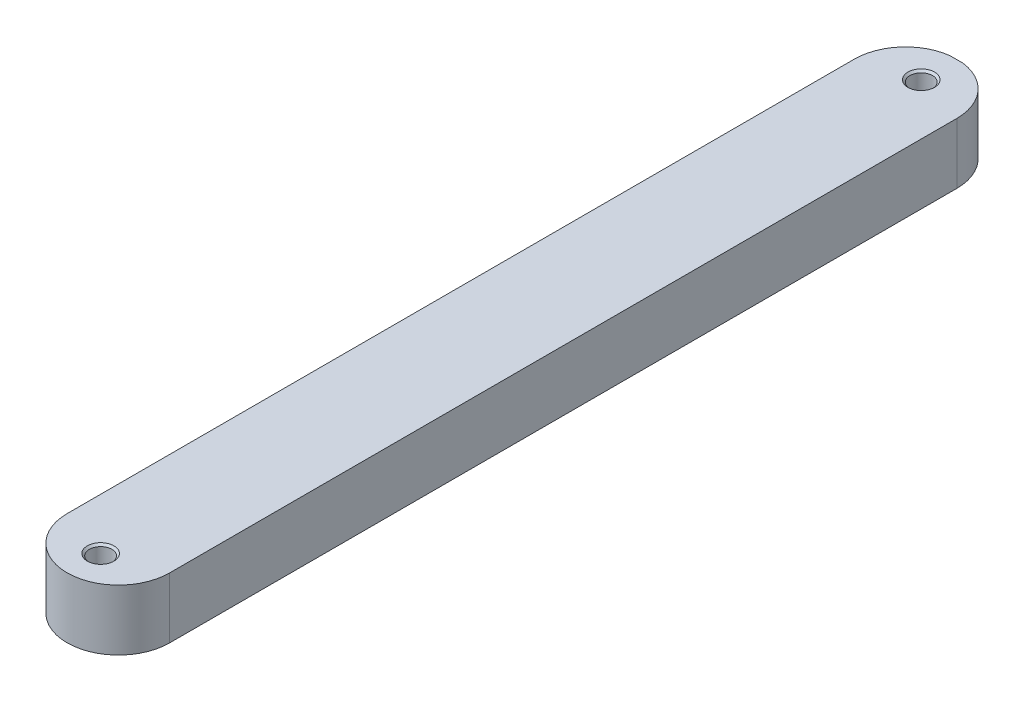
ISO-10303-21;
HEADER;
FILE_DESCRIPTION(('STEP AP214'),'2;1');
FILE_NAME('part.step','',(''),(''),'','','');
FILE_SCHEMA(('AUTOMOTIVE_DESIGN { 1 0 10303 214 1 1 1 1 }'));
ENDSEC;
DATA;
#1=APPLICATION_CONTEXT('core data for automotive mechanical design processes');
#2=APPLICATION_PROTOCOL_DEFINITION('international standard','automotive_design',2000,#1);
#3=PRODUCT_CONTEXT('',#1,'mechanical');
#4=PRODUCT('Part','Part','',(#3));
#5=PRODUCT_RELATED_PRODUCT_CATEGORY('part','',(#4));
#6=PRODUCT_DEFINITION_FORMATION('','',#4);
#7=PRODUCT_DEFINITION_CONTEXT('part definition',#1,'design');
#8=PRODUCT_DEFINITION('design','',#6,#7);
#9=PRODUCT_DEFINITION_SHAPE('','',#8);
#10=(LENGTH_UNIT() NAMED_UNIT(*) SI_UNIT(.MILLI.,.METRE.));
#11=(NAMED_UNIT(*) PLANE_ANGLE_UNIT() SI_UNIT($,.RADIAN.));
#12=(NAMED_UNIT(*) SI_UNIT($,.STERADIAN.) SOLID_ANGLE_UNIT());
#13=UNCERTAINTY_MEASURE_WITH_UNIT(LENGTH_MEASURE(1.E-05),#10,'distance_accuracy_value','');
#14=(GEOMETRIC_REPRESENTATION_CONTEXT(3) GLOBAL_UNCERTAINTY_ASSIGNED_CONTEXT((#13)) GLOBAL_UNIT_ASSIGNED_CONTEXT((#10,
#11,#12)) REPRESENTATION_CONTEXT('',''));
#15=CARTESIAN_POINT('',(0.,0.,0.));
#16=DIRECTION('',(0.,0.,1.));
#17=DIRECTION('',(1.,0.,0.));
#18=AXIS2_PLACEMENT_3D('',#15,#16,#17);
#19=CARTESIAN_POINT('',(30.,0.,0.));
#20=DIRECTION('',(1.,0.,0.));
#21=DIRECTION('',(0.,0.,-1.));
#22=AXIS2_PLACEMENT_3D('',#19,#20,#21);
#23=PLANE('',#22);
#24=DIRECTION('',(0.,1.,0.));
#25=VECTOR('',#24,1.);
#26=CARTESIAN_POINT('',(30.,-31.081342300485,-215.122561861937));
#27=LINE('',#26,#25);
#28=CARTESIAN_POINT('',(30.,-18.8062966576299,-215.122561861937));
#29=VERTEX_POINT('',#28);
#30=CARTESIAN_POINT('',(30.,-1.081342300485,-215.122561861937));
#31=VERTEX_POINT('',#30);
#32=EDGE_CURVE('E136',#29,#31,#27,.T.);
#33=ORIENTED_EDGE('',*,*,#32,.T.);
#34=DIRECTION('',(0.,0.,-1.));
#35=VECTOR('',#34,1.);
#36=CARTESIAN_POINT('',(30.,-1.081342300485,30.));
#37=LINE('',#36,#35);
#38=CARTESIAN_POINT('',(30.,-1.081342300485,15.));
#39=VERTEX_POINT('',#38);
#40=EDGE_CURVE('E120',#39,#31,#37,.T.);
#41=ORIENTED_EDGE('',*,*,#40,.F.);
#42=DIRECTION('',(0.,1.,0.));
#43=VECTOR('',#42,1.);
#44=CARTESIAN_POINT('',(30.,-19.081342300485,15.));
#45=LINE('',#44,#43);
#46=CARTESIAN_POINT('',(30.,-18.8062966576299,15.));
#47=VERTEX_POINT('',#46);
#48=EDGE_CURVE('E170',#47,#39,#45,.T.);
#49=ORIENTED_EDGE('',*,*,#48,.F.);
#50=DIRECTION('',(0.,0.,-1.));
#51=VECTOR('',#50,1.);
#52=CARTESIAN_POINT('',(30.,-18.8062966576299,30.));
#53=LINE('',#52,#51);
#54=EDGE_CURVE('E183',#47,#29,#53,.T.);
#55=ORIENTED_EDGE('',*,*,#54,.T.);
#56=EDGE_LOOP('',(#33,#41,#49,#55));
#57=FACE_BOUND('',#56,.T.);
#58=ADVANCED_FACE('F58',(#57),#23,.T.);
#59=CARTESIAN_POINT('',(0.,0.,0.));
#60=DIRECTION('',(1.,0.,0.));
#61=DIRECTION('',(0.,0.,-1.));
#62=AXIS2_PLACEMENT_3D('',#59,#60,#61);
#63=PLANE('',#62);
#64=DIRECTION('',(0.,0.,-1.));
#65=VECTOR('',#64,1.);
#66=CARTESIAN_POINT('',(0.,-1.081342300485,30.));
#67=LINE('',#66,#65);
#68=CARTESIAN_POINT('',(0.,-1.081342300485,15.));
#69=VERTEX_POINT('',#68);
#70=CARTESIAN_POINT('',(0.,-1.081342300485,-215.122561861937));
#71=VERTEX_POINT('',#70);
#72=EDGE_CURVE('E114',#69,#71,#67,.T.);
#73=ORIENTED_EDGE('',*,*,#72,.T.);
#74=DIRECTION('',(0.,1.,0.));
#75=VECTOR('',#74,1.);
#76=CARTESIAN_POINT('',(0.,-31.081342300485,-215.122561861937));
#77=LINE('',#76,#75);
#78=CARTESIAN_POINT('',(0.,-18.8062966576299,-215.122561861937));
#79=VERTEX_POINT('',#78);
#80=EDGE_CURVE('E116',#79,#71,#77,.T.);
#81=ORIENTED_EDGE('',*,*,#80,.F.);
#82=DIRECTION('',(0.,0.,-1.));
#83=VECTOR('',#82,1.);
#84=CARTESIAN_POINT('',(0.,-18.8062966576299,30.));
#85=LINE('',#84,#83);
#86=CARTESIAN_POINT('',(0.,-18.8062966576299,15.));
#87=VERTEX_POINT('',#86);
#88=EDGE_CURVE('E186',#87,#79,#85,.T.);
#89=ORIENTED_EDGE('',*,*,#88,.F.);
#90=DIRECTION('',(0.,1.,0.));
#91=VECTOR('',#90,1.);
#92=CARTESIAN_POINT('',(0.,-19.081342300485,15.));
#93=LINE('',#92,#91);
#94=EDGE_CURVE('E117',#87,#69,#93,.T.);
#95=ORIENTED_EDGE('',*,*,#94,.T.);
#96=EDGE_LOOP('',(#73,#81,#89,#95));
#97=FACE_BOUND('',#96,.T.);
#98=ADVANCED_FACE('F60',(#97),#63,.F.);
#99=CARTESIAN_POINT('',(0.,0.,-230.));
#100=DIRECTION('',(0.,0.,-1.));
#101=DIRECTION('',(-1.,0.,0.));
#102=AXIS2_PLACEMENT_3D('',#99,#100,#101);
#103=PLANE('',#102);
#104=DIRECTION('',(-1.,0.,0.));
#105=VECTOR('',#104,1.);
#106=CARTESIAN_POINT('',(30.,-18.8062966576299,-230.));
#107=LINE('',#106,#105);
#108=CARTESIAN_POINT('',(16.9135920276072,-18.8062966576299,-230.));
#109=VERTEX_POINT('',#108);
#110=CARTESIAN_POINT('',(13.0864079723928,-18.8062966576299,-230.));
#111=VERTEX_POINT('',#110);
#112=EDGE_CURVE('E152',#109,#111,#107,.T.);
#113=ORIENTED_EDGE('',*,*,#112,.T.);
#114=DIRECTION('',(0.,1.,0.));
#115=VECTOR('',#114,1.);
#116=CARTESIAN_POINT('',(13.0864079723928,-31.081342300485,-230.));
#117=LINE('',#116,#115);
#118=CARTESIAN_POINT('',(13.0864079723928,-1.081342300485,-230.));
#119=VERTEX_POINT('',#118);
#120=EDGE_CURVE('E12',#111,#119,#117,.T.);
#121=ORIENTED_EDGE('',*,*,#120,.T.);
#122=DIRECTION('',(1.,0.,0.));
#123=VECTOR('',#122,1.);
#124=CARTESIAN_POINT('',(30.,-1.081342300485,-230.));
#125=LINE('',#124,#123);
#126=CARTESIAN_POINT('',(16.9135920276072,-1.081342300485,-230.));
#127=VERTEX_POINT('',#126);
#128=EDGE_CURVE('E134',#119,#127,#125,.T.);
#129=ORIENTED_EDGE('',*,*,#128,.T.);
#130=DIRECTION('',(0.,1.,0.));
#131=VECTOR('',#130,1.);
#132=CARTESIAN_POINT('',(16.9135920276072,-31.081342300485,-230.));
#133=LINE('',#132,#131);
#134=EDGE_CURVE('E67',#127,#109,#133,.F.);
#135=ORIENTED_EDGE('',*,*,#134,.T.);
#136=EDGE_LOOP('',(#113,#121,#129,#135));
#137=FACE_BOUND('',#136,.T.);
#138=ADVANCED_FACE('F191',(#137),#103,.T.);
#139=CARTESIAN_POINT('',(0.,-1.081342300485,30.));
#140=DIRECTION('',(0.,-1.,0.));
#141=DIRECTION('',(0.,0.,-1.));
#142=AXIS2_PLACEMENT_3D('',#139,#140,#141);
#143=PLANE('',#142);
#144=CARTESIAN_POINT('',(15.,-1.081342300485,15.));
#145=DIRECTION('',(0.,1.,0.));
#146=DIRECTION('',(0.,0.,1.));
#147=AXIS2_PLACEMENT_3D('',#144,#145,#146);
#148=CIRCLE('',#147,15.);
#149=EDGE_CURVE('E174',#69,#39,#148,.T.);
#150=ORIENTED_EDGE('',*,*,#149,.T.);
#151=ORIENTED_EDGE('',*,*,#40,.T.);
#152=CARTESIAN_POINT('',(15.,-1.081342300485,-215.122561861937));
#153=DIRECTION('',(0.,1.,0.));
#154=DIRECTION('',(0.,0.,1.));
#155=AXIS2_PLACEMENT_3D('',#152,#153,#154);
#156=CIRCLE('',#155,15.);
#157=EDGE_CURVE('E140',#31,#127,#156,.T.);
#158=ORIENTED_EDGE('',*,*,#157,.T.);
#159=ORIENTED_EDGE('',*,*,#128,.F.);
#160=CARTESIAN_POINT('',(15.,-1.081342300485,-215.122561861937));
#161=DIRECTION('',(0.,1.,0.));
#162=DIRECTION('',(0.,0.,1.));
#163=AXIS2_PLACEMENT_3D('',#160,#161,#162);
#164=CIRCLE('',#163,15.);
#165=EDGE_CURVE('E74',#119,#71,#164,.T.);
#166=ORIENTED_EDGE('',*,*,#165,.T.);
#167=ORIENTED_EDGE('',*,*,#72,.F.);
#168=EDGE_LOOP('',(#150,#151,#158,#159,#166,#167));
#169=FACE_BOUND('',#168,.T.);
#170=CARTESIAN_POINT('',(15.,-1.081342300485,20.2038916555903));
#171=DIRECTION('',(0.,1.,0.));
#172=DIRECTION('',(0.,0.,1.));
#173=AXIS2_PLACEMENT_3D('',#170,#171,#172);
#174=CIRCLE('',#173,3.8865);
#175=CARTESIAN_POINT('',(15.,-1.081342300485,24.0903916555903));
#176=VERTEX_POINT('',#175);
#177=EDGE_CURVE('E158',#176,#176,#174,.T.);
#178=ORIENTED_EDGE('',*,*,#177,.F.);
#179=EDGE_LOOP('',(#178));
#180=FACE_BOUND('',#179,.T.);
#181=CARTESIAN_POINT('',(15.,-1.081342300485,-219.701584921538));
#182=DIRECTION('',(0.,1.,0.));
#183=DIRECTION('',(0.,0.,1.));
#184=AXIS2_PLACEMENT_3D('',#181,#182,#183);
#185=CIRCLE('',#184,3.8865);
#186=CARTESIAN_POINT('',(15.,-1.081342300485,-215.815084921538));
#187=VERTEX_POINT('',#186);
#188=EDGE_CURVE('E345',#187,#187,#185,.T.);
#189=ORIENTED_EDGE('',*,*,#188,.F.);
#190=EDGE_LOOP('',(#189));
#191=FACE_BOUND('',#190,.T.);
#192=ADVANCED_FACE('F130',(#169,#180,#191),#143,.F.);
#193=CARTESIAN_POINT('',(0.,-18.8062966576299,30.));
#194=DIRECTION('',(0.,1.,0.));
#195=DIRECTION('',(0.,0.,1.));
#196=AXIS2_PLACEMENT_3D('',#193,#194,#195);
#197=PLANE('',#196);
#198=CARTESIAN_POINT('',(15.,-18.8062966576299,20.2038916555903));
#199=DIRECTION('',(0.,1.,0.));
#200=DIRECTION('',(0.,0.,1.));
#201=AXIS2_PLACEMENT_3D('',#198,#199,#200);
#202=CIRCLE('',#201,3.3);
#203=CARTESIAN_POINT('',(15.,-18.8062966576299,23.5038916555903));
#204=VERTEX_POINT('',#203);
#205=EDGE_CURVE('E166',#204,#204,#202,.T.);
#206=ORIENTED_EDGE('',*,*,#205,.T.);
#207=EDGE_LOOP('',(#206));
#208=FACE_BOUND('',#207,.T.);
#209=ORIENTED_EDGE('',*,*,#54,.F.);
#210=CARTESIAN_POINT('',(15.,-18.8062966576299,15.));
#211=DIRECTION('',(0.,1.,0.));
#212=DIRECTION('',(0.,0.,1.));
#213=AXIS2_PLACEMENT_3D('',#210,#211,#212);
#214=CIRCLE('',#213,15.);
#215=EDGE_CURVE('E121',#87,#47,#214,.T.);
#216=ORIENTED_EDGE('',*,*,#215,.F.);
#217=ORIENTED_EDGE('',*,*,#88,.T.);
#218=CARTESIAN_POINT('',(15.,-18.8062966576299,-215.122561861937));
#219=DIRECTION('',(0.,1.,0.));
#220=DIRECTION('',(0.,0.,1.));
#221=AXIS2_PLACEMENT_3D('',#218,#219,#220);
#222=CIRCLE('',#221,15.);
#223=EDGE_CURVE('E126',#111,#79,#222,.T.);
#224=ORIENTED_EDGE('',*,*,#223,.F.);
#225=ORIENTED_EDGE('',*,*,#112,.F.);
#226=CARTESIAN_POINT('',(15.,-18.8062966576299,-215.122561861937));
#227=DIRECTION('',(0.,1.,0.));
#228=DIRECTION('',(0.,0.,1.));
#229=AXIS2_PLACEMENT_3D('',#226,#227,#228);
#230=CIRCLE('',#229,15.);
#231=EDGE_CURVE('E81',#29,#109,#230,.T.);
#232=ORIENTED_EDGE('',*,*,#231,.F.);
#233=EDGE_LOOP('',(#209,#216,#217,#224,#225,#232));
#234=FACE_BOUND('',#233,.T.);
#235=CARTESIAN_POINT('',(15.,-18.8062966576299,-219.701584921538));
#236=DIRECTION('',(0.,1.,0.));
#237=DIRECTION('',(0.,0.,1.));
#238=AXIS2_PLACEMENT_3D('',#235,#236,#237);
#239=CIRCLE('',#238,3.29999999999999);
#240=CARTESIAN_POINT('',(15.,-18.8062966576299,-216.401584921538));
#241=VERTEX_POINT('',#240);
#242=EDGE_CURVE('E143',#241,#241,#239,.T.);
#243=ORIENTED_EDGE('',*,*,#242,.T.);
#244=EDGE_LOOP('',(#243));
#245=FACE_BOUND('',#244,.T.);
#246=ADVANCED_FACE('F195',(#208,#234,#245),#197,.F.);
#247=CARTESIAN_POINT('',(15.,-19.081342300485,15.));
#248=DIRECTION('',(0.,1.,0.));
#249=DIRECTION('',(0.,0.,1.));
#250=AXIS2_PLACEMENT_3D('',#247,#248,#249);
#251=CYLINDRICAL_SURFACE('',#250,15.);
#252=ORIENTED_EDGE('',*,*,#215,.T.);
#253=ORIENTED_EDGE('',*,*,#48,.T.);
#254=ORIENTED_EDGE('',*,*,#149,.F.);
#255=ORIENTED_EDGE('',*,*,#94,.F.);
#256=EDGE_LOOP('',(#252,#253,#254,#255));
#257=FACE_BOUND('',#256,.T.);
#258=ADVANCED_FACE('F200',(#257),#251,.T.);
#259=CARTESIAN_POINT('',(15.,-1.081342300485,20.2038916555903));
#260=DIRECTION('',(0.,1.,0.));
#261=DIRECTION('',(0.,0.,1.));
#262=AXIS2_PLACEMENT_3D('',#259,#260,#261);
#263=CYLINDRICAL_SURFACE('',#262,3.3);
#264=ORIENTED_EDGE('',*,*,#205,.F.);
#265=EDGE_LOOP('',(#264));
#266=FACE_BOUND('',#265,.T.);
#267=CARTESIAN_POINT('',(15.,-1.667842300485,20.2038916555903));
#268=DIRECTION('',(0.,1.,0.));
#269=DIRECTION('',(0.,0.,1.));
#270=AXIS2_PLACEMENT_3D('',#267,#268,#269);
#271=CIRCLE('',#270,3.3);
#272=CARTESIAN_POINT('',(15.,-1.667842300485,23.5038916555903));
#273=VERTEX_POINT('',#272);
#274=EDGE_CURVE('E162',#273,#273,#271,.T.);
#275=ORIENTED_EDGE('',*,*,#274,.T.);
#276=EDGE_LOOP('',(#275));
#277=FACE_BOUND('',#276,.T.);
#278=ADVANCED_FACE('F213',(#266,#277),#263,.F.);
#279=CARTESIAN_POINT('',(15.,-1.081342300485,20.2038916555903));
#280=DIRECTION('',(0.,1.,0.));
#281=DIRECTION('',(0.,0.,1.));
#282=AXIS2_PLACEMENT_3D('',#279,#280,#281);
#283=CONICAL_SURFACE('',#282,3.8865,0.785398163397447);
#284=ORIENTED_EDGE('',*,*,#274,.F.);
#285=EDGE_LOOP('',(#284));
#286=FACE_BOUND('',#285,.T.);
#287=ORIENTED_EDGE('',*,*,#177,.T.);
#288=EDGE_LOOP('',(#287));
#289=FACE_BOUND('',#288,.T.);
#290=ADVANCED_FACE('F205',(#286,#289),#283,.F.);
#291=CARTESIAN_POINT('',(15.,-31.081342300485,-215.122561861937));
#292=DIRECTION('',(0.,1.,0.));
#293=DIRECTION('',(0.,0.,1.));
#294=AXIS2_PLACEMENT_3D('',#291,#292,#293);
#295=CYLINDRICAL_SURFACE('',#294,15.);
#296=ORIENTED_EDGE('',*,*,#231,.T.);
#297=ORIENTED_EDGE('',*,*,#134,.F.);
#298=ORIENTED_EDGE('',*,*,#157,.F.);
#299=ORIENTED_EDGE('',*,*,#32,.F.);
#300=EDGE_LOOP('',(#296,#297,#298,#299));
#301=FACE_BOUND('',#300,.T.);
#302=ADVANCED_FACE('F203',(#301),#295,.T.);
#303=CARTESIAN_POINT('',(15.,-31.081342300485,-215.122561861937));
#304=DIRECTION('',(0.,1.,0.));
#305=DIRECTION('',(0.,0.,1.));
#306=AXIS2_PLACEMENT_3D('',#303,#304,#305);
#307=CYLINDRICAL_SURFACE('',#306,15.);
#308=ORIENTED_EDGE('',*,*,#223,.T.);
#309=ORIENTED_EDGE('',*,*,#80,.T.);
#310=ORIENTED_EDGE('',*,*,#165,.F.);
#311=ORIENTED_EDGE('',*,*,#120,.F.);
#312=EDGE_LOOP('',(#308,#309,#310,#311));
#313=FACE_BOUND('',#312,.T.);
#314=ADVANCED_FACE('F124',(#313),#307,.T.);
#315=CARTESIAN_POINT('',(15.,-1.081342300485,-219.701584921538));
#316=DIRECTION('',(0.,1.,0.));
#317=DIRECTION('',(0.,0.,1.));
#318=AXIS2_PLACEMENT_3D('',#315,#316,#317);
#319=CYLINDRICAL_SURFACE('',#318,3.29999999999999);
#320=ORIENTED_EDGE('',*,*,#242,.F.);
#321=EDGE_LOOP('',(#320));
#322=FACE_BOUND('',#321,.T.);
#323=CARTESIAN_POINT('',(15.,-1.667842300485,-219.701584921538));
#324=DIRECTION('',(0.,1.,0.));
#325=DIRECTION('',(0.,0.,1.));
#326=AXIS2_PLACEMENT_3D('',#323,#324,#325);
#327=CIRCLE('',#326,3.29999999999999);
#328=CARTESIAN_POINT('',(15.,-1.667842300485,-216.401584921538));
#329=VERTEX_POINT('',#328);
#330=EDGE_CURVE('E343',#329,#329,#327,.T.);
#331=ORIENTED_EDGE('',*,*,#330,.T.);
#332=EDGE_LOOP('',(#331));
#333=FACE_BOUND('',#332,.T.);
#334=ADVANCED_FACE('F211',(#322,#333),#319,.F.);
#335=CARTESIAN_POINT('',(15.,-1.081342300485,-219.701584921538));
#336=DIRECTION('',(0.,1.,0.));
#337=DIRECTION('',(0.,0.,1.));
#338=AXIS2_PLACEMENT_3D('',#335,#336,#337);
#339=CONICAL_SURFACE('',#338,3.8865,0.785398163397456);
#340=ORIENTED_EDGE('',*,*,#330,.F.);
#341=EDGE_LOOP('',(#340));
#342=FACE_BOUND('',#341,.T.);
#343=ORIENTED_EDGE('',*,*,#188,.T.);
#344=EDGE_LOOP('',(#343));
#345=FACE_BOUND('',#344,.T.);
#346=ADVANCED_FACE('F282',(#342,#345),#339,.F.);
#347=CLOSED_SHELL('',(#58,#98,#138,#192,#246,#258,#278,#290,#302,#314,#334,#346));
#348=MANIFOLD_SOLID_BREP('B2',#347);
#349=ADVANCED_BREP_SHAPE_REPRESENTATION('',(#18,#348),#14);
#350=SHAPE_DEFINITION_REPRESENTATION(#9,#349);
ENDSEC;
END-ISO-10303-21;
